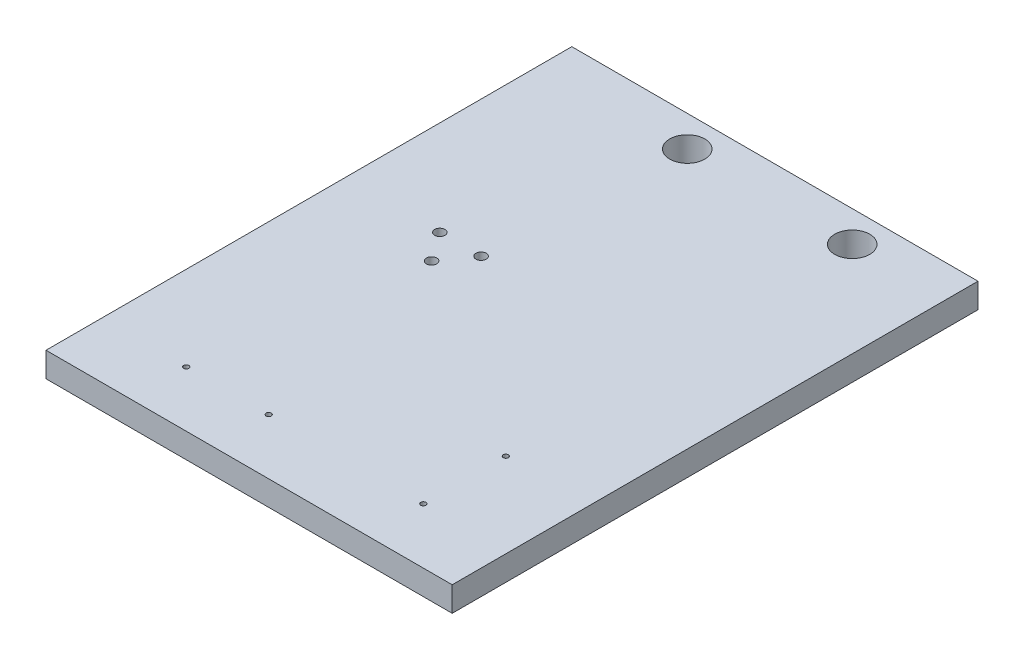
ISO-10303-21;
HEADER;
FILE_DESCRIPTION(('STEP AP214'),'2;1');
FILE_NAME('part.step','',(''),(''),'','','');
FILE_SCHEMA(('AUTOMOTIVE_DESIGN { 1 0 10303 214 1 1 1 1 }'));
ENDSEC;
DATA;
#1=APPLICATION_CONTEXT('core data for automotive mechanical design processes');
#2=APPLICATION_PROTOCOL_DEFINITION('international standard','automotive_design',2000,#1);
#3=PRODUCT_CONTEXT('',#1,'mechanical');
#4=PRODUCT('Part','Part','',(#3));
#5=PRODUCT_RELATED_PRODUCT_CATEGORY('part','',(#4));
#6=PRODUCT_DEFINITION_FORMATION('','',#4);
#7=PRODUCT_DEFINITION_CONTEXT('part definition',#1,'design');
#8=PRODUCT_DEFINITION('design','',#6,#7);
#9=PRODUCT_DEFINITION_SHAPE('','',#8);
#10=(LENGTH_UNIT() NAMED_UNIT(*) SI_UNIT(.MILLI.,.METRE.));
#11=(NAMED_UNIT(*) PLANE_ANGLE_UNIT() SI_UNIT($,.RADIAN.));
#12=(NAMED_UNIT(*) SI_UNIT($,.STERADIAN.) SOLID_ANGLE_UNIT());
#13=UNCERTAINTY_MEASURE_WITH_UNIT(LENGTH_MEASURE(1.E-05),#10,'distance_accuracy_value','');
#14=(GEOMETRIC_REPRESENTATION_CONTEXT(3) GLOBAL_UNCERTAINTY_ASSIGNED_CONTEXT((#13)) GLOBAL_UNIT_ASSIGNED_CONTEXT((#10,
#11,#12)) REPRESENTATION_CONTEXT('',''));
#15=CARTESIAN_POINT('',(0.,0.,0.));
#16=DIRECTION('',(0.,0.,1.));
#17=DIRECTION('',(1.,0.,0.));
#18=AXIS2_PLACEMENT_3D('',#15,#16,#17);
#19=CARTESIAN_POINT('',(57.5,5.99999999997181,100.5));
#20=DIRECTION('',(0.,1.,0.));
#21=DIRECTION('',(0.,0.,1.));
#22=AXIS2_PLACEMENT_3D('',#19,#20,#21);
#23=CONICAL_SURFACE('',#22,1.24999999995953,1.0297442586752);
#24=CARTESIAN_POINT('',(57.5,6.,100.5));
#25=DIRECTION('',(0.,1.,0.));
#26=DIRECTION('',(0.,0.,1.));
#27=AXIS2_PLACEMENT_3D('',#24,#25,#26);
#28=CIRCLE('',#27,1.25);
#29=CARTESIAN_POINT('',(56.2500000000085,6.00000000000716,100.5));
#30=VERTEX_POINT('',#29);
#31=CARTESIAN_POINT('',(58.7499999999937,6.00000000000716,100.5));
#32=VERTEX_POINT('',#31);
#33=EDGE_CURVE('E120',#30,#32,#28,.T.);
#34=ORIENTED_EDGE('',*,*,#33,.T.);
#35=DIRECTION('',(-0.857167300703835,-0.515038074907187,0.));
#36=VECTOR('',#35,1.);
#37=CARTESIAN_POINT('',(498957.,299774.311324496,100.500000000031));
#38=LINE('',#37,#36);
#39=CARTESIAN_POINT('',(57.4999999999761,5.24892422626522,100.5));
#40=VERTEX_POINT('',#39);
#41=EDGE_CURVE('E113',#32,#40,#38,.T.);
#42=ORIENTED_EDGE('',*,*,#41,.T.);
#43=DIRECTION('',(0.857167300703835,-0.515038074907187,0.));
#44=VECTOR('',#43,1.);
#45=CARTESIAN_POINT('',(-498842.,299774.311324496,100.499999999908));
#46=LINE('',#45,#44);
#47=EDGE_CURVE('E110',#40,#30,#46,.F.);
#48=ORIENTED_EDGE('',*,*,#47,.T.);
#49=EDGE_LOOP('',(#34,#42,#48));
#50=FACE_BOUND('',#49,.T.);
#51=ADVANCED_FACE('F17',(#50),#23,.F.);
#52=CARTESIAN_POINT('',(57.5,6.00000000002865,100.5));
#53=DIRECTION('',(0.,1.,0.));
#54=DIRECTION('',(0.,0.,1.));
#55=AXIS2_PLACEMENT_3D('',#52,#53,#54);
#56=CONICAL_SURFACE('',#55,1.24999999998135,1.02974425866186);
#57=ORIENTED_EDGE('',*,*,#47,.F.);
#58=ORIENTED_EDGE('',*,*,#41,.F.);
#59=CARTESIAN_POINT('',(57.5,6.,100.5));
#60=DIRECTION('',(0.,1.,0.));
#61=DIRECTION('',(0.,0.,1.));
#62=AXIS2_PLACEMENT_3D('',#59,#60,#61);
#63=CIRCLE('',#62,1.25);
#64=EDGE_CURVE('E116',#32,#30,#63,.T.);
#65=ORIENTED_EDGE('',*,*,#64,.T.);
#66=EDGE_LOOP('',(#57,#58,#65));
#67=FACE_BOUND('',#66,.T.);
#68=ADVANCED_FACE('F112',(#67),#56,.F.);
#69=CARTESIAN_POINT('',(-17.5,5.99999999997181,100.5));
#70=DIRECTION('',(0.,1.,0.));
#71=DIRECTION('',(0.,0.,1.));
#72=AXIS2_PLACEMENT_3D('',#69,#70,#71);
#73=CONICAL_SURFACE('',#72,1.24999999995953,1.0297442586752);
#74=CARTESIAN_POINT('',(-17.5,6.,100.5));
#75=DIRECTION('',(0.,1.,0.));
#76=DIRECTION('',(0.,0.,1.));
#77=AXIS2_PLACEMENT_3D('',#74,#75,#76);
#78=CIRCLE('',#77,1.25);
#79=CARTESIAN_POINT('',(-18.7499999999886,6.00000000000716,100.5));
#80=VERTEX_POINT('',#79);
#81=CARTESIAN_POINT('',(-16.2500000000034,6.00000000000716,100.5));
#82=VERTEX_POINT('',#81);
#83=EDGE_CURVE('E247',#80,#82,#78,.T.);
#84=ORIENTED_EDGE('',*,*,#83,.T.);
#85=DIRECTION('',(-0.857167300703835,-0.515038074907187,0.));
#86=VECTOR('',#85,1.);
#87=CARTESIAN_POINT('',(498882.,299774.311324496,100.500000000031));
#88=LINE('',#87,#86);
#89=CARTESIAN_POINT('',(-17.5000000000125,5.24892422626522,100.5));
#90=VERTEX_POINT('',#89);
#91=EDGE_CURVE('E118',#82,#90,#88,.T.);
#92=ORIENTED_EDGE('',*,*,#91,.T.);
#93=DIRECTION('',(0.857167300703835,-0.515038074907187,0.));
#94=VECTOR('',#93,1.);
#95=CARTESIAN_POINT('',(-498917.,299774.311324496,100.499999999908));
#96=LINE('',#95,#94);
#97=EDGE_CURVE('E244',#90,#80,#96,.F.);
#98=ORIENTED_EDGE('',*,*,#97,.T.);
#99=EDGE_LOOP('',(#84,#92,#98));
#100=FACE_BOUND('',#99,.T.);
#101=ADVANCED_FACE('F270',(#100),#73,.F.);
#102=CARTESIAN_POINT('',(-17.5,6.00000000002865,100.5));
#103=DIRECTION('',(0.,1.,0.));
#104=DIRECTION('',(0.,0.,1.));
#105=AXIS2_PLACEMENT_3D('',#102,#103,#104);
#106=CONICAL_SURFACE('',#105,1.24999999998135,1.02974425866186);
#107=ORIENTED_EDGE('',*,*,#97,.F.);
#108=ORIENTED_EDGE('',*,*,#91,.F.);
#109=CARTESIAN_POINT('',(-17.5,6.,100.5));
#110=DIRECTION('',(0.,1.,0.));
#111=DIRECTION('',(0.,0.,1.));
#112=AXIS2_PLACEMENT_3D('',#109,#110,#111);
#113=CIRCLE('',#112,1.25);
#114=EDGE_CURVE('E230',#82,#80,#113,.T.);
#115=ORIENTED_EDGE('',*,*,#114,.T.);
#116=EDGE_LOOP('',(#107,#108,#115));
#117=FACE_BOUND('',#116,.T.);
#118=ADVANCED_FACE('F273',(#117),#106,.F.);
#119=CARTESIAN_POINT('',(57.5,5.99999999991496,60.5));
#120=DIRECTION('',(0.,1.,0.));
#121=DIRECTION('',(-1.,0.,0.));
#122=AXIS2_PLACEMENT_3D('',#119,#120,#121);
#123=CONICAL_SURFACE('',#122,1.24999999975262,1.02974425843444);
#124=CARTESIAN_POINT('',(57.5,6.,60.5));
#125=DIRECTION('',(0.,1.,0.));
#126=DIRECTION('',(0.,0.,1.));
#127=AXIS2_PLACEMENT_3D('',#124,#125,#126);
#128=CIRCLE('',#127,1.25);
#129=CARTESIAN_POINT('',(56.2500000000512,5.99999999997874,60.5));
#130=VERTEX_POINT('',#129);
#131=CARTESIAN_POINT('',(58.7499999999227,5.99999999996453,60.5));
#132=VERTEX_POINT('',#131);
#133=EDGE_CURVE('E227',#130,#132,#128,.T.);
#134=ORIENTED_EDGE('',*,*,#133,.T.);
#135=DIRECTION('',(-0.857167300703836,-0.515038074907186,0.));
#136=VECTOR('',#135,1.);
#137=CARTESIAN_POINT('',(498997.,299798.345749255,60.5000000000305));
#138=LINE('',#137,#136);
#139=CARTESIAN_POINT('',(57.5000000002319,5.24892422615153,60.5));
#140=VERTEX_POINT('',#139);
#141=EDGE_CURVE('E239',#132,#140,#138,.T.);
#142=ORIENTED_EDGE('',*,*,#141,.T.);
#143=DIRECTION('',(0.857167300703836,-0.515038074907186,0.));
#144=VECTOR('',#143,1.);
#145=CARTESIAN_POINT('',(-498882.,299798.345749255,60.4999999999083));
#146=LINE('',#145,#144);
#147=EDGE_CURVE('E224',#140,#130,#146,.F.);
#148=ORIENTED_EDGE('',*,*,#147,.T.);
#149=EDGE_LOOP('',(#134,#142,#148));
#150=FACE_BOUND('',#149,.T.);
#151=ADVANCED_FACE('F415',(#150),#123,.F.);
#152=CARTESIAN_POINT('',(57.5,5.99999999991496,60.5));
#153=DIRECTION('',(0.,1.,0.));
#154=DIRECTION('',(-1.,0.,0.));
#155=AXIS2_PLACEMENT_3D('',#152,#153,#154);
#156=CONICAL_SURFACE('',#155,1.24999999979036,1.02974425838754);
#157=ORIENTED_EDGE('',*,*,#147,.F.);
#158=ORIENTED_EDGE('',*,*,#141,.F.);
#159=CARTESIAN_POINT('',(57.5,6.,60.5));
#160=DIRECTION('',(0.,1.,0.));
#161=DIRECTION('',(0.,0.,1.));
#162=AXIS2_PLACEMENT_3D('',#159,#160,#161);
#163=CIRCLE('',#162,1.25);
#164=EDGE_CURVE('E210',#132,#130,#163,.T.);
#165=ORIENTED_EDGE('',*,*,#164,.T.);
#166=EDGE_LOOP('',(#157,#158,#165));
#167=FACE_BOUND('',#166,.T.);
#168=ADVANCED_FACE('F411',(#167),#156,.F.);
#169=CARTESIAN_POINT('',(-57.5,5.99999999997181,100.5));
#170=DIRECTION('',(0.,1.,0.));
#171=DIRECTION('',(0.,0.,1.));
#172=AXIS2_PLACEMENT_3D('',#169,#170,#171);
#173=CONICAL_SURFACE('',#172,1.24999999995953,1.0297442586752);
#174=CARTESIAN_POINT('',(-57.5,6.,100.5));
#175=DIRECTION('',(0.,1.,0.));
#176=DIRECTION('',(0.,0.,1.));
#177=AXIS2_PLACEMENT_3D('',#174,#175,#176);
#178=CIRCLE('',#177,1.25);
#179=CARTESIAN_POINT('',(-58.7499999999937,6.00000000000716,100.5));
#180=VERTEX_POINT('',#179);
#181=CARTESIAN_POINT('',(-56.2500000000085,6.00000000000716,100.5));
#182=VERTEX_POINT('',#181);
#183=EDGE_CURVE('E207',#180,#182,#178,.T.);
#184=ORIENTED_EDGE('',*,*,#183,.T.);
#185=DIRECTION('',(-0.857167300703835,-0.515038074907187,0.));
#186=VECTOR('',#185,1.);
#187=CARTESIAN_POINT('',(498842.,299774.311324496,100.500000000031));
#188=LINE('',#187,#186);
#189=CARTESIAN_POINT('',(-57.500000000033,5.24892422626522,100.5));
#190=VERTEX_POINT('',#189);
#191=EDGE_CURVE('E219',#182,#190,#188,.T.);
#192=ORIENTED_EDGE('',*,*,#191,.T.);
#193=DIRECTION('',(0.857167300703835,-0.515038074907187,0.));
#194=VECTOR('',#193,1.);
#195=CARTESIAN_POINT('',(-498957.,299774.311324496,100.499999999908));
#196=LINE('',#195,#194);
#197=EDGE_CURVE('E204',#190,#180,#196,.F.);
#198=ORIENTED_EDGE('',*,*,#197,.T.);
#199=EDGE_LOOP('',(#184,#192,#198));
#200=FACE_BOUND('',#199,.T.);
#201=ADVANCED_FACE('F407',(#200),#173,.F.);
#202=CARTESIAN_POINT('',(-57.5,6.00000000002865,100.5));
#203=DIRECTION('',(0.,1.,0.));
#204=DIRECTION('',(0.,0.,1.));
#205=AXIS2_PLACEMENT_3D('',#202,#203,#204);
#206=CONICAL_SURFACE('',#205,1.24999999998135,1.02974425866186);
#207=ORIENTED_EDGE('',*,*,#197,.F.);
#208=ORIENTED_EDGE('',*,*,#191,.F.);
#209=CARTESIAN_POINT('',(-57.5,6.,100.5));
#210=DIRECTION('',(0.,1.,0.));
#211=DIRECTION('',(0.,0.,1.));
#212=AXIS2_PLACEMENT_3D('',#209,#210,#211);
#213=CIRCLE('',#212,1.25);
#214=EDGE_CURVE('E190',#182,#180,#213,.T.);
#215=ORIENTED_EDGE('',*,*,#214,.T.);
#216=EDGE_LOOP('',(#207,#208,#215));
#217=FACE_BOUND('',#216,.T.);
#218=ADVANCED_FACE('F403',(#217),#206,.F.);
#219=CARTESIAN_POINT('',(-32.5,7.00000000006185,-17.5));
#220=DIRECTION('',(0.,1.,0.));
#221=DIRECTION('',(0.,0.,1.));
#222=AXIS2_PLACEMENT_3D('',#219,#220,#221);
#223=CONICAL_SURFACE('',#222,2.5000000000955,1.02974425867857);
#224=CARTESIAN_POINT('',(-32.5,7.,-17.5));
#225=DIRECTION('',(0.,1.,0.));
#226=DIRECTION('',(0.,0.,1.));
#227=AXIS2_PLACEMENT_3D('',#224,#225,#226);
#228=CIRCLE('',#227,2.5);
#229=CARTESIAN_POINT('',(-35.0000000000063,7.00000000001546,-17.5));
#230=VERTEX_POINT('',#229);
#231=CARTESIAN_POINT('',(-29.9999999999932,7.00000000001546,-17.5));
#232=VERTEX_POINT('',#231);
#233=EDGE_CURVE('E187',#230,#232,#228,.T.);
#234=ORIENTED_EDGE('',*,*,#233,.T.);
#235=DIRECTION('',(-0.857167300703835,-0.515038074907187,0.));
#236=VECTOR('',#235,1.);
#237=CARTESIAN_POINT('',(498985.,299845.461801766,-17.4999999999695));
#238=LINE('',#237,#236);
#239=CARTESIAN_POINT('',(-32.5000000000557,5.49784845250656,-17.5));
#240=VERTEX_POINT('',#239);
#241=EDGE_CURVE('E199',#232,#240,#238,.T.);
#242=ORIENTED_EDGE('',*,*,#241,.T.);
#243=DIRECTION('',(0.857167300703835,-0.515038074907187,0.));
#244=VECTOR('',#243,1.);
#245=CARTESIAN_POINT('',(-499050.,299845.461801766,-17.5000000000917));
#246=LINE('',#245,#244);
#247=EDGE_CURVE('E184',#240,#230,#246,.F.);
#248=ORIENTED_EDGE('',*,*,#247,.T.);
#249=EDGE_LOOP('',(#234,#242,#248));
#250=FACE_BOUND('',#249,.T.);
#251=ADVANCED_FACE('F399',(#250),#223,.F.);
#252=CARTESIAN_POINT('',(-32.5,7.00000000017553,-17.5));
#253=DIRECTION('',(0.,1.,0.));
#254=DIRECTION('',(0.,0.,1.));
#255=AXIS2_PLACEMENT_3D('',#252,#253,#254);
#256=CONICAL_SURFACE('',#255,2.50000000018417,1.02974425866419);
#257=ORIENTED_EDGE('',*,*,#247,.F.);
#258=ORIENTED_EDGE('',*,*,#241,.F.);
#259=CARTESIAN_POINT('',(-32.5,7.,-17.5));
#260=DIRECTION('',(0.,1.,0.));
#261=DIRECTION('',(0.,0.,1.));
#262=AXIS2_PLACEMENT_3D('',#259,#260,#261);
#263=CIRCLE('',#262,2.5);
#264=EDGE_CURVE('E169',#232,#230,#263,.T.);
#265=ORIENTED_EDGE('',*,*,#264,.T.);
#266=EDGE_LOOP('',(#257,#258,#265));
#267=FACE_BOUND('',#266,.T.);
#268=ADVANCED_FACE('F395',(#267),#256,.F.);
#269=CARTESIAN_POINT('',(-52.5,7.00000000006185,-17.5));
#270=DIRECTION('',(0.,1.,0.));
#271=DIRECTION('',(0.,0.,1.));
#272=AXIS2_PLACEMENT_3D('',#269,#270,#271);
#273=CONICAL_SURFACE('',#272,2.5000000000955,1.02974425867857);
#274=CARTESIAN_POINT('',(-52.5,7.,-17.5));
#275=DIRECTION('',(0.,1.,0.));
#276=DIRECTION('',(0.,0.,1.));
#277=AXIS2_PLACEMENT_3D('',#274,#275,#276);
#278=CIRCLE('',#277,2.5);
#279=CARTESIAN_POINT('',(-55.0000000000017,7.00000000001546,-17.5));
#280=VERTEX_POINT('',#279);
#281=CARTESIAN_POINT('',(-50.0000000000028,7.00000000001546,-17.5));
#282=VERTEX_POINT('',#281);
#283=EDGE_CURVE('E164',#280,#282,#278,.T.);
#284=ORIENTED_EDGE('',*,*,#283,.T.);
#285=DIRECTION('',(-0.857167300703835,-0.515038074907187,0.));
#286=VECTOR('',#285,1.);
#287=CARTESIAN_POINT('',(498965.,299845.461801766,-17.4999999999694));
#288=LINE('',#287,#286);
#289=CARTESIAN_POINT('',(-52.5000000000659,5.49784845250656,-17.5));
#290=VERTEX_POINT('',#289);
#291=EDGE_CURVE('E179',#282,#290,#288,.T.);
#292=ORIENTED_EDGE('',*,*,#291,.T.);
#293=DIRECTION('',(0.857167300703835,-0.515038074907187,0.));
#294=VECTOR('',#293,1.);
#295=CARTESIAN_POINT('',(-499070.,299845.461801766,-17.5000000000917));
#296=LINE('',#295,#294);
#297=EDGE_CURVE('E176',#290,#280,#296,.F.);
#298=ORIENTED_EDGE('',*,*,#297,.T.);
#299=EDGE_LOOP('',(#284,#292,#298));
#300=FACE_BOUND('',#299,.T.);
#301=ADVANCED_FACE('F392',(#300),#273,.F.);
#302=CARTESIAN_POINT('',(-52.5,7.00000000006185,-17.5));
#303=DIRECTION('',(0.,1.,0.));
#304=DIRECTION('',(0.,0.,1.));
#305=AXIS2_PLACEMENT_3D('',#302,#303,#304);
#306=CONICAL_SURFACE('',#305,2.50000000001364,1.02974425866749);
#307=ORIENTED_EDGE('',*,*,#297,.F.);
#308=ORIENTED_EDGE('',*,*,#291,.F.);
#309=CARTESIAN_POINT('',(-52.5,7.,-17.5));
#310=DIRECTION('',(0.,1.,0.));
#311=DIRECTION('',(0.,0.,1.));
#312=AXIS2_PLACEMENT_3D('',#309,#310,#311);
#313=CIRCLE('',#312,2.5);
#314=EDGE_CURVE('E160',#282,#280,#313,.T.);
#315=ORIENTED_EDGE('',*,*,#314,.T.);
#316=EDGE_LOOP('',(#307,#308,#315));
#317=FACE_BOUND('',#316,.T.);
#318=ADVANCED_FACE('F389',(#317),#306,.F.);
#319=CARTESIAN_POINT('',(-42.5,7.,-3.5));
#320=DIRECTION('',(0.,-1.,0.));
#321=DIRECTION('',(0.,0.,-1.));
#322=AXIS2_PLACEMENT_3D('',#319,#320,#321);
#323=PLANE('',#322);
#324=CARTESIAN_POINT('',(-42.5,7.,-3.5));
#325=DIRECTION('',(0.,-1.,0.));
#326=DIRECTION('',(0.,0.,-1.));
#327=AXIS2_PLACEMENT_3D('',#324,#325,#326);
#328=CIRCLE('',#327,2.5);
#329=CARTESIAN_POINT('',(-42.5,7.,-6.));
#330=VERTEX_POINT('',#329);
#331=EDGE_CURVE('E20',#330,#330,#328,.F.);
#332=ORIENTED_EDGE('',*,*,#331,.T.);
#333=EDGE_LOOP('',(#332));
#334=FACE_BOUND('',#333,.T.);
#335=ADVANCED_FACE('F385',(#334),#323,.F.);
#336=CARTESIAN_POINT('',(57.5,4.91137043753,100.5));
#337=DIRECTION('',(0.,1.,0.));
#338=DIRECTION('',(0.,0.,1.));
#339=AXIS2_PLACEMENT_3D('',#336,#337,#338);
#340=CYLINDRICAL_SURFACE('',#339,1.25);
#341=ORIENTED_EDGE('',*,*,#64,.F.);
#342=ORIENTED_EDGE('',*,*,#33,.F.);
#343=EDGE_LOOP('',(#341,#342));
#344=FACE_BOUND('',#343,.T.);
#345=CARTESIAN_POINT('',(57.5,12.,100.5));
#346=DIRECTION('',(0.,1.,0.));
#347=DIRECTION('',(0.,0.,1.));
#348=AXIS2_PLACEMENT_3D('',#345,#346,#347);
#349=CIRCLE('',#348,1.25);
#350=CARTESIAN_POINT('',(57.5,12.,101.75));
#351=VERTEX_POINT('',#350);
#352=EDGE_CURVE('E155',#351,#351,#349,.F.);
#353=ORIENTED_EDGE('',*,*,#352,.F.);
#354=EDGE_LOOP('',(#353));
#355=FACE_BOUND('',#354,.T.);
#356=ADVANCED_FACE('F279',(#344,#355),#340,.F.);
#357=CARTESIAN_POINT('',(-17.5,4.91137043753,100.5));
#358=DIRECTION('',(0.,1.,0.));
#359=DIRECTION('',(0.,0.,1.));
#360=AXIS2_PLACEMENT_3D('',#357,#358,#359);
#361=CYLINDRICAL_SURFACE('',#360,1.25);
#362=ORIENTED_EDGE('',*,*,#114,.F.);
#363=ORIENTED_EDGE('',*,*,#83,.F.);
#364=EDGE_LOOP('',(#362,#363));
#365=FACE_BOUND('',#364,.T.);
#366=CARTESIAN_POINT('',(-17.5,12.,100.5));
#367=DIRECTION('',(0.,1.,0.));
#368=DIRECTION('',(0.,0.,1.));
#369=AXIS2_PLACEMENT_3D('',#366,#367,#368);
#370=CIRCLE('',#369,1.25);
#371=CARTESIAN_POINT('',(-17.5,12.,101.75));
#372=VERTEX_POINT('',#371);
#373=EDGE_CURVE('E153',#372,#372,#370,.F.);
#374=ORIENTED_EDGE('',*,*,#373,.F.);
#375=EDGE_LOOP('',(#374));
#376=FACE_BOUND('',#375,.T.);
#377=ADVANCED_FACE('F275',(#365,#376),#361,.F.);
#378=CARTESIAN_POINT('',(57.5,4.91137043753,60.5));
#379=DIRECTION('',(0.,1.,0.));
#380=DIRECTION('',(0.,0.,1.));
#381=AXIS2_PLACEMENT_3D('',#378,#379,#380);
#382=CYLINDRICAL_SURFACE('',#381,1.25);
#383=ORIENTED_EDGE('',*,*,#164,.F.);
#384=ORIENTED_EDGE('',*,*,#133,.F.);
#385=EDGE_LOOP('',(#383,#384));
#386=FACE_BOUND('',#385,.T.);
#387=CARTESIAN_POINT('',(57.5,12.,60.5));
#388=DIRECTION('',(0.,1.,0.));
#389=DIRECTION('',(0.,0.,1.));
#390=AXIS2_PLACEMENT_3D('',#387,#388,#389);
#391=CIRCLE('',#390,1.25);
#392=CARTESIAN_POINT('',(57.5,12.,61.75));
#393=VERTEX_POINT('',#392);
#394=EDGE_CURVE('E150',#393,#393,#391,.F.);
#395=ORIENTED_EDGE('',*,*,#394,.F.);
#396=EDGE_LOOP('',(#395));
#397=FACE_BOUND('',#396,.T.);
#398=ADVANCED_FACE('F278',(#386,#397),#382,.F.);
#399=CARTESIAN_POINT('',(-57.5,4.91137043753,100.5));
#400=DIRECTION('',(0.,1.,0.));
#401=DIRECTION('',(0.,0.,1.));
#402=AXIS2_PLACEMENT_3D('',#399,#400,#401);
#403=CYLINDRICAL_SURFACE('',#402,1.25);
#404=ORIENTED_EDGE('',*,*,#214,.F.);
#405=ORIENTED_EDGE('',*,*,#183,.F.);
#406=EDGE_LOOP('',(#404,#405));
#407=FACE_BOUND('',#406,.T.);
#408=CARTESIAN_POINT('',(-57.5,12.,100.5));
#409=DIRECTION('',(0.,1.,0.));
#410=DIRECTION('',(0.,0.,1.));
#411=AXIS2_PLACEMENT_3D('',#408,#409,#410);
#412=CIRCLE('',#411,1.25);
#413=CARTESIAN_POINT('',(-57.5,12.,101.75));
#414=VERTEX_POINT('',#413);
#415=EDGE_CURVE('E147',#414,#414,#412,.F.);
#416=ORIENTED_EDGE('',*,*,#415,.F.);
#417=EDGE_LOOP('',(#416));
#418=FACE_BOUND('',#417,.T.);
#419=ADVANCED_FACE('F371',(#407,#418),#403,.F.);
#420=CARTESIAN_POINT('',(-32.5,4.92274087505,-17.5));
#421=DIRECTION('',(0.,1.,0.));
#422=DIRECTION('',(0.,0.,1.));
#423=AXIS2_PLACEMENT_3D('',#420,#421,#422);
#424=CYLINDRICAL_SURFACE('',#423,2.5);
#425=ORIENTED_EDGE('',*,*,#264,.F.);
#426=ORIENTED_EDGE('',*,*,#233,.F.);
#427=EDGE_LOOP('',(#425,#426));
#428=FACE_BOUND('',#427,.T.);
#429=CARTESIAN_POINT('',(-32.5,12.,-17.5));
#430=DIRECTION('',(0.,1.,0.));
#431=DIRECTION('',(0.,0.,1.));
#432=AXIS2_PLACEMENT_3D('',#429,#430,#431);
#433=CIRCLE('',#432,2.5);
#434=CARTESIAN_POINT('',(-32.5,12.,-15.));
#435=VERTEX_POINT('',#434);
#436=EDGE_CURVE('E144',#435,#435,#433,.F.);
#437=ORIENTED_EDGE('',*,*,#436,.F.);
#438=EDGE_LOOP('',(#437));
#439=FACE_BOUND('',#438,.T.);
#440=ADVANCED_FACE('F377',(#428,#439),#424,.F.);
#441=CARTESIAN_POINT('',(-52.5,4.92274087505,-17.5));
#442=DIRECTION('',(0.,1.,0.));
#443=DIRECTION('',(0.,0.,1.));
#444=AXIS2_PLACEMENT_3D('',#441,#442,#443);
#445=CYLINDRICAL_SURFACE('',#444,2.5);
#446=ORIENTED_EDGE('',*,*,#314,.F.);
#447=ORIENTED_EDGE('',*,*,#283,.F.);
#448=EDGE_LOOP('',(#446,#447));
#449=FACE_BOUND('',#448,.T.);
#450=CARTESIAN_POINT('',(-52.5,12.,-17.5));
#451=DIRECTION('',(0.,1.,0.));
#452=DIRECTION('',(0.,0.,1.));
#453=AXIS2_PLACEMENT_3D('',#450,#451,#452);
#454=CIRCLE('',#453,2.5);
#455=CARTESIAN_POINT('',(-52.5,12.,-15.));
#456=VERTEX_POINT('',#455);
#457=EDGE_CURVE('E141',#456,#456,#454,.F.);
#458=ORIENTED_EDGE('',*,*,#457,.F.);
#459=EDGE_LOOP('',(#458));
#460=FACE_BOUND('',#459,.T.);
#461=ADVANCED_FACE('F540',(#449,#460),#445,.F.);
#462=CARTESIAN_POINT('',(-42.5,27.,-3.5));
#463=DIRECTION('',(0.,-1.,0.));
#464=DIRECTION('',(0.,0.,-1.));
#465=AXIS2_PLACEMENT_3D('',#462,#463,#464);
#466=CYLINDRICAL_SURFACE('',#465,2.5);
#467=ORIENTED_EDGE('',*,*,#331,.F.);
#468=EDGE_LOOP('',(#467));
#469=FACE_BOUND('',#468,.T.);
#470=CARTESIAN_POINT('',(-42.5,12.,-3.5));
#471=DIRECTION('',(0.,-1.,0.));
#472=DIRECTION('',(0.,0.,-1.));
#473=AXIS2_PLACEMENT_3D('',#470,#471,#472);
#474=CIRCLE('',#473,2.5);
#475=CARTESIAN_POINT('',(-42.5,12.,-6.));
#476=VERTEX_POINT('',#475);
#477=EDGE_CURVE('E137',#476,#476,#474,.T.);
#478=ORIENTED_EDGE('',*,*,#477,.F.);
#479=EDGE_LOOP('',(#478));
#480=FACE_BOUND('',#479,.T.);
#481=ADVANCED_FACE('F286',(#469,#480),#466,.F.);
#482=CARTESIAN_POINT('',(0.,12.,0.));
#483=DIRECTION('',(0.,1.,0.));
#484=DIRECTION('',(0.,0.,1.));
#485=AXIS2_PLACEMENT_3D('',#482,#483,#484);
#486=PLANE('',#485);
#487=ORIENTED_EDGE('',*,*,#477,.T.);
#488=EDGE_LOOP('',(#487));
#489=FACE_BOUND('',#488,.T.);
#490=CARTESIAN_POINT('',(52.5,12.,-112.5));
#491=DIRECTION('',(0.,1.,0.));
#492=DIRECTION('',(0.,0.,1.));
#493=AXIS2_PLACEMENT_3D('',#490,#491,#492);
#494=CIRCLE('',#493,8.5);
#495=CARTESIAN_POINT('',(52.5,12.,-104.));
#496=VERTEX_POINT('',#495);
#497=EDGE_CURVE('E130',#496,#496,#494,.F.);
#498=ORIENTED_EDGE('',*,*,#497,.T.);
#499=EDGE_LOOP('',(#498));
#500=FACE_BOUND('',#499,.T.);
#501=CARTESIAN_POINT('',(-27.5,12.,-112.5));
#502=DIRECTION('',(0.,-1.,0.));
#503=DIRECTION('',(0.,0.,-1.));
#504=AXIS2_PLACEMENT_3D('',#501,#502,#503);
#505=CIRCLE('',#504,8.5);
#506=CARTESIAN_POINT('',(-27.5,12.,-121.));
#507=VERTEX_POINT('',#506);
#508=EDGE_CURVE('E134',#507,#507,#505,.T.);
#509=ORIENTED_EDGE('',*,*,#508,.T.);
#510=EDGE_LOOP('',(#509));
#511=FACE_BOUND('',#510,.T.);
#512=ORIENTED_EDGE('',*,*,#457,.T.);
#513=EDGE_LOOP('',(#512));
#514=FACE_BOUND('',#513,.T.);
#515=ORIENTED_EDGE('',*,*,#436,.T.);
#516=EDGE_LOOP('',(#515));
#517=FACE_BOUND('',#516,.T.);
#518=ORIENTED_EDGE('',*,*,#415,.T.);
#519=EDGE_LOOP('',(#518));
#520=FACE_BOUND('',#519,.T.);
#521=ORIENTED_EDGE('',*,*,#394,.T.);
#522=EDGE_LOOP('',(#521));
#523=FACE_BOUND('',#522,.T.);
#524=ORIENTED_EDGE('',*,*,#373,.T.);
#525=EDGE_LOOP('',(#524));
#526=FACE_BOUND('',#525,.T.);
#527=ORIENTED_EDGE('',*,*,#352,.T.);
#528=EDGE_LOOP('',(#527));
#529=FACE_BOUND('',#528,.T.);
#530=DIRECTION('',(-1.,0.,0.));
#531=VECTOR('',#530,1.);
#532=CARTESIAN_POINT('',(98.5,12.,-127.5));
#533=LINE('',#532,#531);
#534=CARTESIAN_POINT('',(-98.5,12.,-127.5));
#535=VERTEX_POINT('',#534);
#536=CARTESIAN_POINT('',(98.5,12.,-127.5));
#537=VERTEX_POINT('',#536);
#538=EDGE_CURVE('E293',#535,#537,#533,.F.);
#539=ORIENTED_EDGE('',*,*,#538,.F.);
#540=DIRECTION('',(0.,0.,1.));
#541=VECTOR('',#540,1.);
#542=CARTESIAN_POINT('',(-98.5,12.,-127.5));
#543=LINE('',#542,#541);
#544=CARTESIAN_POINT('',(-98.5,12.,127.5));
#545=VERTEX_POINT('',#544);
#546=EDGE_CURVE('E140',#545,#535,#543,.F.);
#547=ORIENTED_EDGE('',*,*,#546,.F.);
#548=DIRECTION('',(1.,0.,0.));
#549=VECTOR('',#548,1.);
#550=CARTESIAN_POINT('',(-98.5,12.,127.5));
#551=LINE('',#550,#549);
#552=CARTESIAN_POINT('',(98.5,12.,127.5));
#553=VERTEX_POINT('',#552);
#554=EDGE_CURVE('E309',#553,#545,#551,.F.);
#555=ORIENTED_EDGE('',*,*,#554,.F.);
#556=DIRECTION('',(0.,0.,-1.));
#557=VECTOR('',#556,1.);
#558=CARTESIAN_POINT('',(98.5,12.,127.5));
#559=LINE('',#558,#557);
#560=EDGE_CURVE('E296',#537,#553,#559,.F.);
#561=ORIENTED_EDGE('',*,*,#560,.F.);
#562=EDGE_LOOP('',(#539,#547,#555,#561));
#563=FACE_BOUND('',#562,.T.);
#564=ADVANCED_FACE('F283',(#489,#500,#511,#514,#517,#520,#523,#526,#529,#563),#486,.T.);
#565=CARTESIAN_POINT('',(-98.5,0.,-127.5));
#566=DIRECTION('',(-1.,0.,0.));
#567=DIRECTION('',(0.,0.,1.));
#568=AXIS2_PLACEMENT_3D('',#565,#566,#567);
#569=PLANE('',#568);
#570=DIRECTION('',(0.,1.,0.));
#571=VECTOR('',#570,1.);
#572=CARTESIAN_POINT('',(-98.5,0.,-127.5));
#573=LINE('',#572,#571);
#574=CARTESIAN_POINT('',(-98.5,0.,-127.5));
#575=VERTEX_POINT('',#574);
#576=EDGE_CURVE('E298',#575,#535,#573,.T.);
#577=ORIENTED_EDGE('',*,*,#576,.F.);
#578=DIRECTION('',(0.,0.,1.));
#579=VECTOR('',#578,1.);
#580=CARTESIAN_POINT('',(-98.5,0.,0.));
#581=LINE('',#580,#579);
#582=CARTESIAN_POINT('',(-98.5,0.,127.5));
#583=VERTEX_POINT('',#582);
#584=EDGE_CURVE('E133',#575,#583,#581,.T.);
#585=ORIENTED_EDGE('',*,*,#584,.T.);
#586=DIRECTION('',(0.,1.,0.));
#587=VECTOR('',#586,1.);
#588=CARTESIAN_POINT('',(-98.5,0.,127.5));
#589=LINE('',#588,#587);
#590=EDGE_CURVE('E307',#545,#583,#589,.F.);
#591=ORIENTED_EDGE('',*,*,#590,.F.);
#592=ORIENTED_EDGE('',*,*,#546,.T.);
#593=EDGE_LOOP('',(#577,#585,#591,#592));
#594=FACE_BOUND('',#593,.T.);
#595=ADVANCED_FACE('F285',(#594),#569,.T.);
#596=CARTESIAN_POINT('',(-98.5,0.,127.5));
#597=DIRECTION('',(0.,0.,1.));
#598=DIRECTION('',(1.,0.,0.));
#599=AXIS2_PLACEMENT_3D('',#596,#597,#598);
#600=PLANE('',#599);
#601=ORIENTED_EDGE('',*,*,#590,.T.);
#602=DIRECTION('',(1.,0.,0.));
#603=VECTOR('',#602,1.);
#604=CARTESIAN_POINT('',(0.,0.,127.5));
#605=LINE('',#604,#603);
#606=CARTESIAN_POINT('',(98.5,0.,127.5));
#607=VERTEX_POINT('',#606);
#608=EDGE_CURVE('E320',#583,#607,#605,.T.);
#609=ORIENTED_EDGE('',*,*,#608,.T.);
#610=DIRECTION('',(0.,1.,0.));
#611=VECTOR('',#610,1.);
#612=CARTESIAN_POINT('',(98.5,0.,127.5));
#613=LINE('',#612,#611);
#614=EDGE_CURVE('E301',#553,#607,#613,.F.);
#615=ORIENTED_EDGE('',*,*,#614,.F.);
#616=ORIENTED_EDGE('',*,*,#554,.T.);
#617=EDGE_LOOP('',(#601,#609,#615,#616));
#618=FACE_BOUND('',#617,.T.);
#619=ADVANCED_FACE('F328',(#618),#600,.T.);
#620=CARTESIAN_POINT('',(98.5,0.,127.5));
#621=DIRECTION('',(1.,0.,0.));
#622=DIRECTION('',(0.,0.,-1.));
#623=AXIS2_PLACEMENT_3D('',#620,#621,#622);
#624=PLANE('',#623);
#625=ORIENTED_EDGE('',*,*,#614,.T.);
#626=DIRECTION('',(0.,0.,1.));
#627=VECTOR('',#626,1.);
#628=CARTESIAN_POINT('',(98.5,0.,0.));
#629=LINE('',#628,#627);
#630=CARTESIAN_POINT('',(98.5,0.,-127.5));
#631=VERTEX_POINT('',#630);
#632=EDGE_CURVE('E318',#607,#631,#629,.F.);
#633=ORIENTED_EDGE('',*,*,#632,.T.);
#634=DIRECTION('',(0.,1.,0.));
#635=VECTOR('',#634,1.);
#636=CARTESIAN_POINT('',(98.5,0.,-127.5));
#637=LINE('',#636,#635);
#638=EDGE_CURVE('E35',#537,#631,#637,.F.);
#639=ORIENTED_EDGE('',*,*,#638,.F.);
#640=ORIENTED_EDGE('',*,*,#560,.T.);
#641=EDGE_LOOP('',(#625,#633,#639,#640));
#642=FACE_BOUND('',#641,.T.);
#643=ADVANCED_FACE('F330',(#642),#624,.T.);
#644=CARTESIAN_POINT('',(98.5,0.,-127.5));
#645=DIRECTION('',(0.,0.,-1.));
#646=DIRECTION('',(-1.,0.,0.));
#647=AXIS2_PLACEMENT_3D('',#644,#645,#646);
#648=PLANE('',#647);
#649=ORIENTED_EDGE('',*,*,#638,.T.);
#650=DIRECTION('',(1.,0.,0.));
#651=VECTOR('',#650,1.);
#652=CARTESIAN_POINT('',(0.,0.,-127.5));
#653=LINE('',#652,#651);
#654=EDGE_CURVE('E129',#631,#575,#653,.F.);
#655=ORIENTED_EDGE('',*,*,#654,.T.);
#656=ORIENTED_EDGE('',*,*,#576,.T.);
#657=ORIENTED_EDGE('',*,*,#538,.T.);
#658=EDGE_LOOP('',(#649,#655,#656,#657));
#659=FACE_BOUND('',#658,.T.);
#660=ADVANCED_FACE('F314',(#659),#648,.T.);
#661=CARTESIAN_POINT('',(-27.5,12.,-112.5));
#662=DIRECTION('',(0.,-1.,0.));
#663=DIRECTION('',(0.,0.,-1.));
#664=AXIS2_PLACEMENT_3D('',#661,#662,#663);
#665=CYLINDRICAL_SURFACE('',#664,8.5);
#666=ORIENTED_EDGE('',*,*,#508,.F.);
#667=EDGE_LOOP('',(#666));
#668=FACE_BOUND('',#667,.T.);
#669=CARTESIAN_POINT('',(-27.5,0.,-112.5));
#670=DIRECTION('',(0.,-1.,0.));
#671=DIRECTION('',(0.,0.,-1.));
#672=AXIS2_PLACEMENT_3D('',#669,#670,#671);
#673=CIRCLE('',#672,8.5);
#674=CARTESIAN_POINT('',(-27.5,0.,-121.));
#675=VERTEX_POINT('',#674);
#676=EDGE_CURVE('E26',#675,#675,#673,.T.);
#677=ORIENTED_EDGE('',*,*,#676,.T.);
#678=EDGE_LOOP('',(#677));
#679=FACE_BOUND('',#678,.T.);
#680=ADVANCED_FACE('F338',(#668,#679),#665,.F.);
#681=CARTESIAN_POINT('',(52.5,12.,-112.5));
#682=DIRECTION('',(0.,1.,0.));
#683=DIRECTION('',(0.,0.,1.));
#684=AXIS2_PLACEMENT_3D('',#681,#682,#683);
#685=CYLINDRICAL_SURFACE('',#684,8.5);
#686=ORIENTED_EDGE('',*,*,#497,.F.);
#687=EDGE_LOOP('',(#686));
#688=FACE_BOUND('',#687,.T.);
#689=CARTESIAN_POINT('',(52.5,0.,-112.5));
#690=DIRECTION('',(0.,1.,0.));
#691=DIRECTION('',(0.,0.,1.));
#692=AXIS2_PLACEMENT_3D('',#689,#690,#691);
#693=CIRCLE('',#692,8.5);
#694=CARTESIAN_POINT('',(52.5,0.,-104.));
#695=VERTEX_POINT('',#694);
#696=EDGE_CURVE('E11',#695,#695,#693,.F.);
#697=ORIENTED_EDGE('',*,*,#696,.T.);
#698=EDGE_LOOP('',(#697));
#699=FACE_BOUND('',#698,.T.);
#700=ADVANCED_FACE('F342',(#688,#699),#685,.F.);
#701=CARTESIAN_POINT('',(0.,0.,0.));
#702=DIRECTION('',(0.,1.,0.));
#703=DIRECTION('',(0.,0.,1.));
#704=AXIS2_PLACEMENT_3D('',#701,#702,#703);
#705=PLANE('',#704);
#706=ORIENTED_EDGE('',*,*,#696,.F.);
#707=EDGE_LOOP('',(#706));
#708=FACE_BOUND('',#707,.T.);
#709=ORIENTED_EDGE('',*,*,#676,.F.);
#710=EDGE_LOOP('',(#709));
#711=FACE_BOUND('',#710,.T.);
#712=ORIENTED_EDGE('',*,*,#632,.F.);
#713=ORIENTED_EDGE('',*,*,#608,.F.);
#714=ORIENTED_EDGE('',*,*,#584,.F.);
#715=ORIENTED_EDGE('',*,*,#654,.F.);
#716=EDGE_LOOP('',(#712,#713,#714,#715));
#717=FACE_BOUND('',#716,.T.);
#718=ADVANCED_FACE('F325',(#708,#711,#717),#705,.F.);
#719=CLOSED_SHELL('',(#51,#68,#101,#118,#151,#168,#201,#218,#251,#268,#301,#318,#335,#356,#377,
#398,#419,#440,#461,#481,#564,#595,#619,#643,#660,#680,#700,#718));
#720=MANIFOLD_SOLID_BREP('B1',#719);
#721=ADVANCED_BREP_SHAPE_REPRESENTATION('',(#18,#720),#14);
#722=SHAPE_DEFINITION_REPRESENTATION(#9,#721);
ENDSEC;
END-ISO-10303-21;
